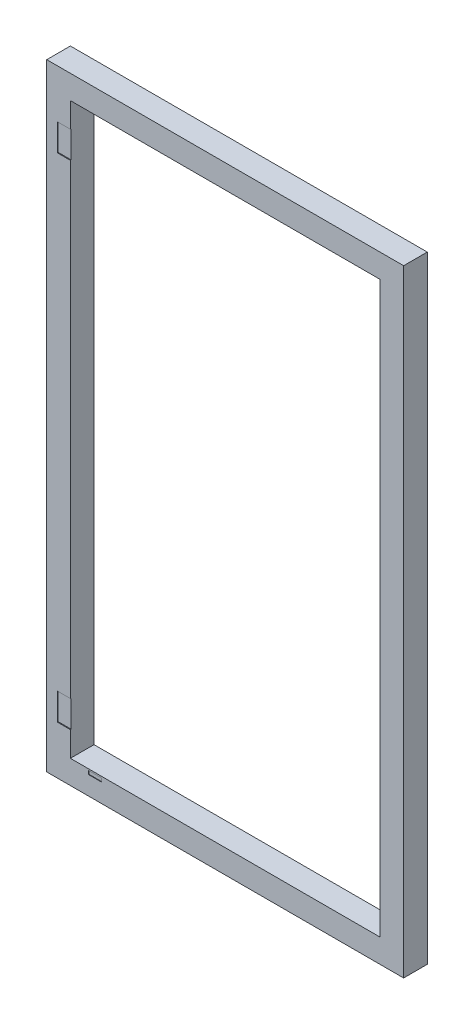
ISO-10303-21;
HEADER;
FILE_DESCRIPTION(('STEP AP214'),'2;1');
FILE_NAME('part.step','',(''),(''),'','','');
FILE_SCHEMA(('AUTOMOTIVE_DESIGN { 1 0 10303 214 1 1 1 1 }'));
ENDSEC;
DATA;
#1=APPLICATION_CONTEXT('core data for automotive mechanical design processes');
#2=APPLICATION_PROTOCOL_DEFINITION('international standard','automotive_design',2000,#1);
#3=PRODUCT_CONTEXT('',#1,'mechanical');
#4=PRODUCT('Part','Part','',(#3));
#5=PRODUCT_RELATED_PRODUCT_CATEGORY('part','',(#4));
#6=PRODUCT_DEFINITION_FORMATION('','',#4);
#7=PRODUCT_DEFINITION_CONTEXT('part definition',#1,'design');
#8=PRODUCT_DEFINITION('design','',#6,#7);
#9=PRODUCT_DEFINITION_SHAPE('','',#8);
#10=(LENGTH_UNIT() NAMED_UNIT(*) SI_UNIT(.MILLI.,.METRE.));
#11=(NAMED_UNIT(*) PLANE_ANGLE_UNIT() SI_UNIT($,.RADIAN.));
#12=(NAMED_UNIT(*) SI_UNIT($,.STERADIAN.) SOLID_ANGLE_UNIT());
#13=UNCERTAINTY_MEASURE_WITH_UNIT(LENGTH_MEASURE(1.E-05),#10,'distance_accuracy_value','');
#14=(GEOMETRIC_REPRESENTATION_CONTEXT(3) GLOBAL_UNCERTAINTY_ASSIGNED_CONTEXT((#13)) GLOBAL_UNIT_ASSIGNED_CONTEXT((#10,
#11,#12)) REPRESENTATION_CONTEXT('',''));
#15=CARTESIAN_POINT('',(0.,0.,0.));
#16=DIRECTION('',(0.,0.,1.));
#17=DIRECTION('',(1.,0.,0.));
#18=AXIS2_PLACEMENT_3D('',#15,#16,#17);
#19=CARTESIAN_POINT('',(1393.0663507109,1229.23815165877,0.01));
#20=DIRECTION('',(1.,0.,0.));
#21=DIRECTION('',(0.,0.,-1.));
#22=AXIS2_PLACEMENT_3D('',#19,#20,#21);
#23=PLANE('',#22);
#24=DIRECTION('',(0.,-1.,0.));
#25=VECTOR('',#24,1.);
#26=CARTESIAN_POINT('',(1393.0663507109,1229.23815165877,0.));
#27=LINE('',#26,#25);
#28=CARTESIAN_POINT('',(1393.0663507109,1229.23815165877,0.));
#29=VERTEX_POINT('',#28);
#30=CARTESIAN_POINT('',(1393.0663507109,1079.23815165877,0.));
#31=VERTEX_POINT('',#30);
#32=EDGE_CURVE('E140',#29,#31,#27,.T.);
#33=ORIENTED_EDGE('',*,*,#32,.F.);
#34=DIRECTION('',(0.,0.,-1.));
#35=VECTOR('',#34,1.);
#36=CARTESIAN_POINT('',(1393.0663507109,1229.23815165877,0.01));
#37=LINE('',#36,#35);
#38=CARTESIAN_POINT('',(1393.0663507109,1229.23815165877,0.01));
#39=VERTEX_POINT('',#38);
#40=EDGE_CURVE('E12',#39,#29,#37,.T.);
#41=ORIENTED_EDGE('',*,*,#40,.F.);
#42=DIRECTION('',(0.,-1.,0.));
#43=VECTOR('',#42,1.);
#44=CARTESIAN_POINT('',(1393.0663507109,1229.23815165877,0.01));
#45=LINE('',#44,#43);
#46=CARTESIAN_POINT('',(1393.0663507109,1079.23815165877,0.01));
#47=VERTEX_POINT('',#46);
#48=EDGE_CURVE('E144',#39,#47,#45,.T.);
#49=ORIENTED_EDGE('',*,*,#48,.T.);
#50=DIRECTION('',(0.,0.,-1.));
#51=VECTOR('',#50,1.);
#52=CARTESIAN_POINT('',(1393.0663507109,1079.23815165877,0.01));
#53=LINE('',#52,#51);
#54=EDGE_CURVE('E45',#47,#31,#53,.T.);
#55=ORIENTED_EDGE('',*,*,#54,.T.);
#56=EDGE_LOOP('',(#33,#41,#49,#55));
#57=FACE_BOUND('',#56,.T.);
#58=ADVANCED_FACE('F42',(#57),#23,.T.);
#59=CARTESIAN_POINT('',(1393.0663507109,1229.23815165877,0.01));
#60=DIRECTION('',(0.,1.,0.));
#61=DIRECTION('',(0.,0.,1.));
#62=AXIS2_PLACEMENT_3D('',#59,#60,#61);
#63=PLANE('',#62);
#64=DIRECTION('',(1.,0.,0.));
#65=VECTOR('',#64,1.);
#66=CARTESIAN_POINT('',(1393.0663507109,1229.23815165877,0.));
#67=LINE('',#66,#65);
#68=CARTESIAN_POINT('',(1303.0663507109,1229.23815165877,0.));
#69=VERTEX_POINT('',#68);
#70=EDGE_CURVE('E148',#69,#29,#67,.T.);
#71=ORIENTED_EDGE('',*,*,#70,.F.);
#72=DIRECTION('',(0.,0.,-1.));
#73=VECTOR('',#72,1.);
#74=CARTESIAN_POINT('',(1303.0663507109,1229.23815165877,0.01));
#75=LINE('',#74,#73);
#76=CARTESIAN_POINT('',(1303.0663507109,1229.23815165877,0.01));
#77=VERTEX_POINT('',#76);
#78=EDGE_CURVE('E50',#77,#69,#75,.T.);
#79=ORIENTED_EDGE('',*,*,#78,.F.);
#80=DIRECTION('',(1.,0.,0.));
#81=VECTOR('',#80,1.);
#82=CARTESIAN_POINT('',(1393.0663507109,1229.23815165877,0.01));
#83=LINE('',#82,#81);
#84=EDGE_CURVE('E154',#77,#39,#83,.T.);
#85=ORIENTED_EDGE('',*,*,#84,.T.);
#86=ORIENTED_EDGE('',*,*,#40,.T.);
#87=EDGE_LOOP('',(#71,#79,#85,#86));
#88=FACE_BOUND('',#87,.T.);
#89=ADVANCED_FACE('F180',(#88),#63,.T.);
#90=CARTESIAN_POINT('',(1303.0663507109,1229.23815165877,0.01));
#91=DIRECTION('',(-1.,0.,0.));
#92=DIRECTION('',(0.,0.,1.));
#93=AXIS2_PLACEMENT_3D('',#90,#91,#92);
#94=PLANE('',#93);
#95=DIRECTION('',(0.,1.,0.));
#96=VECTOR('',#95,1.);
#97=CARTESIAN_POINT('',(1303.0663507109,1229.23815165877,0.));
#98=LINE('',#97,#96);
#99=CARTESIAN_POINT('',(1303.0663507109,1079.23815165877,0.));
#100=VERTEX_POINT('',#99);
#101=EDGE_CURVE('E162',#100,#69,#98,.T.);
#102=ORIENTED_EDGE('',*,*,#101,.F.);
#103=DIRECTION('',(0.,0.,-1.));
#104=VECTOR('',#103,1.);
#105=CARTESIAN_POINT('',(1303.0663507109,1079.23815165877,0.01));
#106=LINE('',#105,#104);
#107=CARTESIAN_POINT('',(1303.0663507109,1079.23815165877,0.01));
#108=VERTEX_POINT('',#107);
#109=EDGE_CURVE('E167',#108,#100,#106,.T.);
#110=ORIENTED_EDGE('',*,*,#109,.F.);
#111=DIRECTION('',(0.,1.,0.));
#112=VECTOR('',#111,1.);
#113=CARTESIAN_POINT('',(1303.0663507109,1229.23815165877,0.01));
#114=LINE('',#113,#112);
#115=EDGE_CURVE('E151',#108,#77,#114,.T.);
#116=ORIENTED_EDGE('',*,*,#115,.T.);
#117=ORIENTED_EDGE('',*,*,#78,.T.);
#118=EDGE_LOOP('',(#102,#110,#116,#117));
#119=FACE_BOUND('',#118,.T.);
#120=ADVANCED_FACE('F184',(#119),#94,.T.);
#121=CARTESIAN_POINT('',(1393.0663507109,1079.23815165877,0.01));
#122=DIRECTION('',(0.,-1.,0.));
#123=DIRECTION('',(0.,0.,-1.));
#124=AXIS2_PLACEMENT_3D('',#121,#122,#123);
#125=PLANE('',#124);
#126=DIRECTION('',(-1.,0.,0.));
#127=VECTOR('',#126,1.);
#128=CARTESIAN_POINT('',(1393.0663507109,1079.23815165877,0.));
#129=LINE('',#128,#127);
#130=EDGE_CURVE('E159',#31,#100,#129,.T.);
#131=ORIENTED_EDGE('',*,*,#130,.F.);
#132=ORIENTED_EDGE('',*,*,#54,.F.);
#133=DIRECTION('',(-1.,0.,0.));
#134=VECTOR('',#133,1.);
#135=CARTESIAN_POINT('',(1393.0663507109,1079.23815165877,0.01));
#136=LINE('',#135,#134);
#137=EDGE_CURVE('E147',#47,#108,#136,.T.);
#138=ORIENTED_EDGE('',*,*,#137,.T.);
#139=ORIENTED_EDGE('',*,*,#109,.T.);
#140=EDGE_LOOP('',(#131,#132,#138,#139));
#141=FACE_BOUND('',#140,.T.);
#142=ADVANCED_FACE('F175',(#141),#125,.T.);
#143=CARTESIAN_POINT('',(0.,0.,0.01));
#144=DIRECTION('',(0.,0.,-1.));
#145=DIRECTION('',(-1.,0.,0.));
#146=AXIS2_PLACEMENT_3D('',#143,#144,#145);
#147=PLANE('',#146);
#148=DIRECTION('',(1.,0.,0.));
#149=VECTOR('',#148,1.);
#150=CARTESIAN_POINT('',(1353.3163507109,1104.73815165877,0.01));
#151=LINE('',#150,#149);
#152=CARTESIAN_POINT('',(1342.8163507109,1104.73815165877,0.01));
#153=VERTEX_POINT('',#152);
#154=CARTESIAN_POINT('',(1353.3163507109,1104.73815165877,0.01));
#155=VERTEX_POINT('',#154);
#156=EDGE_CURVE('E115',#153,#155,#151,.T.);
#157=ORIENTED_EDGE('',*,*,#156,.T.);
#158=DIRECTION('',(0.,-1.,0.));
#159=VECTOR('',#158,1.);
#160=CARTESIAN_POINT('',(1353.3163507109,1104.73815165877,0.01));
#161=LINE('',#160,#159);
#162=CARTESIAN_POINT('',(1353.3163507109,1094.23815165877,0.01));
#163=VERTEX_POINT('',#162);
#164=EDGE_CURVE('E109',#155,#163,#161,.T.);
#165=ORIENTED_EDGE('',*,*,#164,.T.);
#166=DIRECTION('',(-1.,0.,0.));
#167=VECTOR('',#166,1.);
#168=CARTESIAN_POINT('',(1353.3163507109,1094.23815165877,0.01));
#169=LINE('',#168,#167);
#170=CARTESIAN_POINT('',(1342.8163507109,1094.23815165877,0.01));
#171=VERTEX_POINT('',#170);
#172=EDGE_CURVE('E118',#163,#171,#169,.T.);
#173=ORIENTED_EDGE('',*,*,#172,.T.);
#174=DIRECTION('',(0.,1.,0.));
#175=VECTOR('',#174,1.);
#176=CARTESIAN_POINT('',(1342.8163507109,1104.73815165877,0.01));
#177=LINE('',#176,#175);
#178=EDGE_CURVE('E58',#171,#153,#177,.T.);
#179=ORIENTED_EDGE('',*,*,#178,.T.);
#180=EDGE_LOOP('',(#157,#165,#173,#179));
#181=FACE_BOUND('',#180,.T.);
#182=ORIENTED_EDGE('',*,*,#48,.F.);
#183=ORIENTED_EDGE('',*,*,#84,.F.);
#184=ORIENTED_EDGE('',*,*,#115,.F.);
#185=ORIENTED_EDGE('',*,*,#137,.F.);
#186=EDGE_LOOP('',(#182,#183,#184,#185));
#187=FACE_BOUND('',#186,.T.);
#188=ADVANCED_FACE('F122',(#181,#187),#147,.F.);
#189=CARTESIAN_POINT('',(0.,0.,0.));
#190=DIRECTION('',(0.,0.,-1.));
#191=DIRECTION('',(-1.,0.,0.));
#192=AXIS2_PLACEMENT_3D('',#189,#190,#191);
#193=PLANE('',#192);
#194=DIRECTION('',(0.,-1.,0.));
#195=VECTOR('',#194,1.);
#196=CARTESIAN_POINT('',(1353.3163507109,1104.73815165877,0.));
#197=LINE('',#196,#195);
#198=CARTESIAN_POINT('',(1353.3163507109,1104.73815165877,0.));
#199=VERTEX_POINT('',#198);
#200=CARTESIAN_POINT('',(1353.3163507109,1094.23815165877,0.));
#201=VERTEX_POINT('',#200);
#202=EDGE_CURVE('E66',#199,#201,#197,.T.);
#203=ORIENTED_EDGE('',*,*,#202,.F.);
#204=DIRECTION('',(1.,0.,0.));
#205=VECTOR('',#204,1.);
#206=CARTESIAN_POINT('',(1353.3163507109,1104.73815165877,0.));
#207=LINE('',#206,#205);
#208=CARTESIAN_POINT('',(1342.8163507109,1104.73815165877,0.));
#209=VERTEX_POINT('',#208);
#210=EDGE_CURVE('E125',#209,#199,#207,.T.);
#211=ORIENTED_EDGE('',*,*,#210,.F.);
#212=DIRECTION('',(0.,1.,0.));
#213=VECTOR('',#212,1.);
#214=CARTESIAN_POINT('',(1342.8163507109,1104.73815165877,0.));
#215=LINE('',#214,#213);
#216=CARTESIAN_POINT('',(1342.8163507109,1094.23815165877,0.));
#217=VERTEX_POINT('',#216);
#218=EDGE_CURVE('E128',#217,#209,#215,.T.);
#219=ORIENTED_EDGE('',*,*,#218,.F.);
#220=DIRECTION('',(-1.,0.,0.));
#221=VECTOR('',#220,1.);
#222=CARTESIAN_POINT('',(1353.3163507109,1094.23815165877,0.));
#223=LINE('',#222,#221);
#224=EDGE_CURVE('E134',#201,#217,#223,.T.);
#225=ORIENTED_EDGE('',*,*,#224,.F.);
#226=EDGE_LOOP('',(#203,#211,#219,#225));
#227=FACE_BOUND('',#226,.T.);
#228=ORIENTED_EDGE('',*,*,#32,.T.);
#229=ORIENTED_EDGE('',*,*,#130,.T.);
#230=ORIENTED_EDGE('',*,*,#101,.T.);
#231=ORIENTED_EDGE('',*,*,#70,.T.);
#232=EDGE_LOOP('',(#228,#229,#230,#231));
#233=FACE_BOUND('',#232,.T.);
#234=ADVANCED_FACE('F177',(#227,#233),#193,.T.);
#235=CARTESIAN_POINT('',(1353.3163507109,1104.73815165877,0.01));
#236=DIRECTION('',(1.,0.,0.));
#237=DIRECTION('',(0.,1.,0.));
#238=AXIS2_PLACEMENT_3D('',#235,#236,#237);
#239=PLANE('',#238);
#240=ORIENTED_EDGE('',*,*,#202,.T.);
#241=DIRECTION('',(0.,0.,-1.));
#242=VECTOR('',#241,1.);
#243=CARTESIAN_POINT('',(1353.3163507109,1094.23815165877,0.01));
#244=LINE('',#243,#242);
#245=EDGE_CURVE('E105',#163,#201,#244,.T.);
#246=ORIENTED_EDGE('',*,*,#245,.F.);
#247=ORIENTED_EDGE('',*,*,#164,.F.);
#248=DIRECTION('',(0.,0.,-1.));
#249=VECTOR('',#248,1.);
#250=CARTESIAN_POINT('',(1353.3163507109,1104.73815165877,0.01));
#251=LINE('',#250,#249);
#252=EDGE_CURVE('E138',#155,#199,#251,.T.);
#253=ORIENTED_EDGE('',*,*,#252,.T.);
#254=EDGE_LOOP('',(#240,#246,#247,#253));
#255=FACE_BOUND('',#254,.T.);
#256=ADVANCED_FACE('F107',(#255),#239,.F.);
#257=CARTESIAN_POINT('',(1353.3163507109,1104.73815165877,0.01));
#258=DIRECTION('',(0.,1.,0.));
#259=DIRECTION('',(0.,0.,1.));
#260=AXIS2_PLACEMENT_3D('',#257,#258,#259);
#261=PLANE('',#260);
#262=ORIENTED_EDGE('',*,*,#210,.T.);
#263=ORIENTED_EDGE('',*,*,#252,.F.);
#264=ORIENTED_EDGE('',*,*,#156,.F.);
#265=DIRECTION('',(0.,0.,-1.));
#266=VECTOR('',#265,1.);
#267=CARTESIAN_POINT('',(1342.8163507109,1104.73815165877,0.01));
#268=LINE('',#267,#266);
#269=EDGE_CURVE('E141',#153,#209,#268,.T.);
#270=ORIENTED_EDGE('',*,*,#269,.T.);
#271=EDGE_LOOP('',(#262,#263,#264,#270));
#272=FACE_BOUND('',#271,.T.);
#273=ADVANCED_FACE('F235',(#272),#261,.F.);
#274=CARTESIAN_POINT('',(1342.8163507109,1104.73815165877,0.01));
#275=DIRECTION('',(-1.,0.,0.));
#276=DIRECTION('',(0.,0.,1.));
#277=AXIS2_PLACEMENT_3D('',#274,#275,#276);
#278=PLANE('',#277);
#279=ORIENTED_EDGE('',*,*,#218,.T.);
#280=ORIENTED_EDGE('',*,*,#269,.F.);
#281=ORIENTED_EDGE('',*,*,#178,.F.);
#282=DIRECTION('',(0.,0.,-1.));
#283=VECTOR('',#282,1.);
#284=CARTESIAN_POINT('',(1342.8163507109,1094.23815165877,0.01));
#285=LINE('',#284,#283);
#286=EDGE_CURVE('E114',#171,#217,#285,.T.);
#287=ORIENTED_EDGE('',*,*,#286,.T.);
#288=EDGE_LOOP('',(#279,#280,#281,#287));
#289=FACE_BOUND('',#288,.T.);
#290=ADVANCED_FACE('F244',(#289),#278,.F.);
#291=CARTESIAN_POINT('',(1353.3163507109,1094.23815165877,0.01));
#292=DIRECTION('',(0.,-1.,0.));
#293=DIRECTION('',(0.,0.,-1.));
#294=AXIS2_PLACEMENT_3D('',#291,#292,#293);
#295=PLANE('',#294);
#296=ORIENTED_EDGE('',*,*,#224,.T.);
#297=ORIENTED_EDGE('',*,*,#286,.F.);
#298=ORIENTED_EDGE('',*,*,#172,.F.);
#299=ORIENTED_EDGE('',*,*,#245,.T.);
#300=EDGE_LOOP('',(#296,#297,#298,#299));
#301=FACE_BOUND('',#300,.T.);
#302=ADVANCED_FACE('F119',(#301),#295,.F.);
#303=CLOSED_SHELL('',(#58,#89,#120,#142,#188,#234,#256,#273,#290,#302));
#304=MANIFOLD_SOLID_BREP('B2',#303);
#305=CARTESIAN_POINT('',(0.,0.,100.));
#306=DIRECTION('',(0.,0.,1.));
#307=DIRECTION('',(1.,0.,0.));
#308=AXIS2_PLACEMENT_3D('',#305,#306,#307);
#309=PLANE('',#308);
#310=DIRECTION('',(-1.,0.,0.));
#311=VECTOR('',#310,1.);
#312=CARTESIAN_POINT('',(64.7840905963136,-56.9198483412322,100.));
#313=LINE('',#312,#311);
#314=CARTESIAN_POINT('',(119.784090596314,-56.9198483412322,100.));
#315=VERTEX_POINT('',#314);
#316=CARTESIAN_POINT('',(64.7840905963136,-56.9198483412322,100.));
#317=VERTEX_POINT('',#316);
#318=EDGE_CURVE('E294',#315,#317,#313,.T.);
#319=ORIENTED_EDGE('',*,*,#318,.F.);
#320=DIRECTION('',(0.,1.,0.));
#321=VECTOR('',#320,1.);
#322=CARTESIAN_POINT('',(119.784090596314,-56.9198483412322,100.));
#323=LINE('',#322,#321);
#324=CARTESIAN_POINT('',(119.784090596314,-71.9198483412322,100.));
#325=VERTEX_POINT('',#324);
#326=EDGE_CURVE('E487',#325,#315,#323,.T.);
#327=ORIENTED_EDGE('',*,*,#326,.F.);
#328=DIRECTION('',(1.,0.,0.));
#329=VECTOR('',#328,1.);
#330=CARTESIAN_POINT('',(119.784090596314,-71.9198483412322,100.));
#331=LINE('',#330,#329);
#332=CARTESIAN_POINT('',(64.7840905963136,-71.9198483412322,100.));
#333=VERTEX_POINT('',#332);
#334=EDGE_CURVE('E484',#333,#325,#331,.T.);
#335=ORIENTED_EDGE('',*,*,#334,.F.);
#336=DIRECTION('',(0.,-1.,0.));
#337=VECTOR('',#336,1.);
#338=CARTESIAN_POINT('',(64.7840905963136,-64.4198483412322,100.));
#339=LINE('',#338,#337);
#340=EDGE_CURVE('E467',#317,#333,#339,.T.);
#341=ORIENTED_EDGE('',*,*,#340,.F.);
#342=EDGE_LOOP('',(#319,#327,#335,#341));
#343=FACE_BOUND('',#342,.T.);
#344=DIRECTION('',(-1.,0.,0.));
#345=VECTOR('',#344,1.);
#346=CARTESIAN_POINT('',(-67.4336492890997,2254.23815165877,100.));
#347=LINE('',#346,#345);
#348=CARTESIAN_POINT('',(-11.9336492890997,2254.23815165877,100.));
#349=VERTEX_POINT('',#348);
#350=CARTESIAN_POINT('',(-67.4336492890997,2254.23815165877,100.));
#351=VERTEX_POINT('',#350);
#352=EDGE_CURVE('E503',#349,#351,#347,.T.);
#353=ORIENTED_EDGE('',*,*,#352,.F.);
#354=DIRECTION('',(0.,-1.,0.));
#355=VECTOR('',#354,1.);
#356=CARTESIAN_POINT('',(-11.9336492890997,2359.23815165877,100.));
#357=LINE('',#356,#355);
#358=CARTESIAN_POINT('',(-11.9336492890997,2359.23815165877,100.));
#359=VERTEX_POINT('',#358);
#360=EDGE_CURVE('E554',#359,#349,#357,.T.);
#361=ORIENTED_EDGE('',*,*,#360,.F.);
#362=DIRECTION('',(-1.,0.,0.));
#363=VECTOR('',#362,1.);
#364=CARTESIAN_POINT('',(-11.9336492890997,2359.23815165877,100.));
#365=LINE('',#364,#363);
#366=CARTESIAN_POINT('',(1298.0663507109,2359.23815165877,100.));
#367=VERTEX_POINT('',#366);
#368=EDGE_CURVE('E564',#367,#359,#365,.T.);
#369=ORIENTED_EDGE('',*,*,#368,.F.);
#370=DIRECTION('',(0.,1.,0.));
#371=VECTOR('',#370,1.);
#372=CARTESIAN_POINT('',(1298.0663507109,2359.23815165877,100.));
#373=LINE('',#372,#371);
#374=CARTESIAN_POINT('',(1298.0663507109,-50.7618483412322,100.));
#375=VERTEX_POINT('',#374);
#376=EDGE_CURVE('E561',#375,#367,#373,.T.);
#377=ORIENTED_EDGE('',*,*,#376,.F.);
#378=DIRECTION('',(1.,0.,0.));
#379=VECTOR('',#378,1.);
#380=CARTESIAN_POINT('',(-11.9336492890994,-50.7618483412322,100.));
#381=LINE('',#380,#379);
#382=CARTESIAN_POINT('',(-11.9336492890994,-50.7618483412322,100.));
#383=VERTEX_POINT('',#382);
#384=EDGE_CURVE('E557',#383,#375,#381,.T.);
#385=ORIENTED_EDGE('',*,*,#384,.F.);
#386=CARTESIAN_POINT('',(-11.9336492890997,54.2381516587678,100.));
#387=VERTEX_POINT('',#386);
#388=EDGE_CURVE('E559',#387,#383,#357,.T.);
#389=ORIENTED_EDGE('',*,*,#388,.F.);
#390=DIRECTION('',(1.,0.,0.));
#391=VECTOR('',#390,1.);
#392=CARTESIAN_POINT('',(-11.9336492890997,54.2381516587678,100.));
#393=LINE('',#392,#391);
#394=CARTESIAN_POINT('',(-67.4336492890997,54.2381516587678,100.));
#395=VERTEX_POINT('',#394);
#396=EDGE_CURVE('E532',#395,#387,#393,.T.);
#397=ORIENTED_EDGE('',*,*,#396,.F.);
#398=DIRECTION('',(0.,-1.,0.));
#399=VECTOR('',#398,1.);
#400=CARTESIAN_POINT('',(-67.4336492890997,168.238151658768,100.));
#401=LINE('',#400,#399);
#402=CARTESIAN_POINT('',(-67.4336492890997,168.238151658768,100.));
#403=VERTEX_POINT('',#402);
#404=EDGE_CURVE('E543',#403,#395,#401,.T.);
#405=ORIENTED_EDGE('',*,*,#404,.F.);
#406=DIRECTION('',(-1.,0.,0.));
#407=VECTOR('',#406,1.);
#408=CARTESIAN_POINT('',(-11.9336492890997,168.238151658768,100.));
#409=LINE('',#408,#407);
#410=CARTESIAN_POINT('',(-11.9336492890997,168.238151658768,100.));
#411=VERTEX_POINT('',#410);
#412=EDGE_CURVE('E493',#411,#403,#409,.T.);
#413=ORIENTED_EDGE('',*,*,#412,.F.);
#414=CARTESIAN_POINT('',(-11.9336492890997,2140.23815165877,100.));
#415=VERTEX_POINT('',#414);
#416=EDGE_CURVE('E558',#415,#411,#357,.T.);
#417=ORIENTED_EDGE('',*,*,#416,.F.);
#418=DIRECTION('',(1.,0.,0.));
#419=VECTOR('',#418,1.);
#420=CARTESIAN_POINT('',(-67.4336492890997,2140.23815165877,100.));
#421=LINE('',#420,#419);
#422=CARTESIAN_POINT('',(-67.4336492890997,2140.23815165877,100.));
#423=VERTEX_POINT('',#422);
#424=EDGE_CURVE('E514',#423,#415,#421,.T.);
#425=ORIENTED_EDGE('',*,*,#424,.F.);
#426=DIRECTION('',(0.,-1.,0.));
#427=VECTOR('',#426,1.);
#428=CARTESIAN_POINT('',(-67.4336492890997,2254.23815165877,100.));
#429=LINE('',#428,#427);
#430=EDGE_CURVE('E511',#351,#423,#429,.T.);
#431=ORIENTED_EDGE('',*,*,#430,.F.);
#432=EDGE_LOOP('',(#353,#361,#369,#377,#385,#389,#397,#405,#413,#417,#425,#431));
#433=FACE_BOUND('',#432,.T.);
#434=DIRECTION('',(0.,-1.,0.));
#435=VECTOR('',#434,1.);
#436=CARTESIAN_POINT('',(-111.9336492891,2459.23815165877,100.));
#437=LINE('',#436,#435);
#438=CARTESIAN_POINT('',(-111.9336492891,2459.23815165877,100.));
#439=VERTEX_POINT('',#438);
#440=CARTESIAN_POINT('',(-111.933649289099,-150.761848341232,100.));
#441=VERTEX_POINT('',#440);
#442=EDGE_CURVE('E588',#439,#441,#437,.T.);
#443=ORIENTED_EDGE('',*,*,#442,.T.);
#444=DIRECTION('',(1.,0.,0.));
#445=VECTOR('',#444,1.);
#446=CARTESIAN_POINT('',(-111.933649289099,-150.761848341232,100.));
#447=LINE('',#446,#445);
#448=CARTESIAN_POINT('',(1398.0663507109,-150.761848341232,100.));
#449=VERTEX_POINT('',#448);
#450=EDGE_CURVE('E591',#441,#449,#447,.T.);
#451=ORIENTED_EDGE('',*,*,#450,.T.);
#452=DIRECTION('',(0.,1.,0.));
#453=VECTOR('',#452,1.);
#454=CARTESIAN_POINT('',(1398.0663507109,2459.23815165877,100.));
#455=LINE('',#454,#453);
#456=CARTESIAN_POINT('',(1398.0663507109,2459.23815165877,100.));
#457=VERTEX_POINT('',#456);
#458=EDGE_CURVE('E594',#449,#457,#455,.T.);
#459=ORIENTED_EDGE('',*,*,#458,.T.);
#460=DIRECTION('',(-1.,0.,0.));
#461=VECTOR('',#460,1.);
#462=CARTESIAN_POINT('',(-111.9336492891,2459.23815165877,100.));
#463=LINE('',#462,#461);
#464=EDGE_CURVE('E596',#457,#439,#463,.T.);
#465=ORIENTED_EDGE('',*,*,#464,.T.);
#466=EDGE_LOOP('',(#443,#451,#459,#465));
#467=FACE_BOUND('',#466,.T.);
#468=ADVANCED_FACE('F271',(#343,#433,#467),#309,.T.);
#469=CARTESIAN_POINT('',(0.,0.,0.));
#470=DIRECTION('',(0.,0.,1.));
#471=DIRECTION('',(1.,0.,0.));
#472=AXIS2_PLACEMENT_3D('',#469,#470,#471);
#473=PLANE('',#472);
#474=DIRECTION('',(-1.,0.,0.));
#475=VECTOR('',#474,1.);
#476=CARTESIAN_POINT('',(1393.0663507109,1079.23815165877,0.));
#477=LINE('',#476,#475);
#478=CARTESIAN_POINT('',(1393.0663507109,1079.23815165877,0.));
#479=VERTEX_POINT('',#478);
#480=CARTESIAN_POINT('',(1303.0663507109,1079.23815165877,0.));
#481=VERTEX_POINT('',#480);
#482=EDGE_CURVE('E461',#479,#481,#477,.T.);
#483=ORIENTED_EDGE('',*,*,#482,.F.);
#484=DIRECTION('',(0.,-1.,0.));
#485=VECTOR('',#484,1.);
#486=CARTESIAN_POINT('',(1393.0663507109,1229.23815165877,0.));
#487=LINE('',#486,#485);
#488=CARTESIAN_POINT('',(1393.0663507109,1229.23815165877,0.));
#489=VERTEX_POINT('',#488);
#490=EDGE_CURVE('E286',#489,#479,#487,.T.);
#491=ORIENTED_EDGE('',*,*,#490,.F.);
#492=DIRECTION('',(1.,0.,0.));
#493=VECTOR('',#492,1.);
#494=CARTESIAN_POINT('',(1393.0663507109,1229.23815165877,0.));
#495=LINE('',#494,#493);
#496=CARTESIAN_POINT('',(1303.0663507109,1229.23815165877,0.));
#497=VERTEX_POINT('',#496);
#498=EDGE_CURVE('E452',#497,#489,#495,.T.);
#499=ORIENTED_EDGE('',*,*,#498,.F.);
#500=DIRECTION('',(0.,1.,0.));
#501=VECTOR('',#500,1.);
#502=CARTESIAN_POINT('',(1303.0663507109,1229.23815165877,0.));
#503=LINE('',#502,#501);
#504=EDGE_CURVE('E455',#481,#497,#503,.T.);
#505=ORIENTED_EDGE('',*,*,#504,.F.);
#506=EDGE_LOOP('',(#483,#491,#499,#505));
#507=FACE_BOUND('',#506,.T.);
#508=DIRECTION('',(0.,-1.,0.));
#509=VECTOR('',#508,1.);
#510=CARTESIAN_POINT('',(-111.9336492891,2459.23815165877,0.));
#511=LINE('',#510,#509);
#512=CARTESIAN_POINT('',(-111.9336492891,2459.23815165877,0.));
#513=VERTEX_POINT('',#512);
#514=CARTESIAN_POINT('',(-111.933649289099,-150.761848341232,0.));
#515=VERTEX_POINT('',#514);
#516=EDGE_CURVE('E587',#513,#515,#511,.T.);
#517=ORIENTED_EDGE('',*,*,#516,.F.);
#518=DIRECTION('',(-1.,0.,0.));
#519=VECTOR('',#518,1.);
#520=CARTESIAN_POINT('',(-111.9336492891,2459.23815165877,0.));
#521=LINE('',#520,#519);
#522=CARTESIAN_POINT('',(1398.0663507109,2459.23815165877,0.));
#523=VERTEX_POINT('',#522);
#524=EDGE_CURVE('E592',#523,#513,#521,.T.);
#525=ORIENTED_EDGE('',*,*,#524,.F.);
#526=DIRECTION('',(0.,1.,0.));
#527=VECTOR('',#526,1.);
#528=CARTESIAN_POINT('',(1398.0663507109,2459.23815165877,0.));
#529=LINE('',#528,#527);
#530=CARTESIAN_POINT('',(1398.0663507109,-150.761848341232,0.));
#531=VERTEX_POINT('',#530);
#532=EDGE_CURVE('E603',#531,#523,#529,.T.);
#533=ORIENTED_EDGE('',*,*,#532,.F.);
#534=DIRECTION('',(1.,0.,0.));
#535=VECTOR('',#534,1.);
#536=CARTESIAN_POINT('',(-111.933649289099,-150.761848341232,0.));
#537=LINE('',#536,#535);
#538=EDGE_CURVE('E601',#515,#531,#537,.T.);
#539=ORIENTED_EDGE('',*,*,#538,.F.);
#540=EDGE_LOOP('',(#517,#525,#533,#539));
#541=FACE_BOUND('',#540,.T.);
#542=DIRECTION('',(0.,-1.,0.));
#543=VECTOR('',#542,1.);
#544=CARTESIAN_POINT('',(-11.9336492890997,2359.23815165877,0.));
#545=LINE('',#544,#543);
#546=CARTESIAN_POINT('',(-11.9336492890997,2359.23815165877,0.));
#547=VERTEX_POINT('',#546);
#548=CARTESIAN_POINT('',(-11.9336492890994,-50.7618483412322,0.));
#549=VERTEX_POINT('',#548);
#550=EDGE_CURVE('E521',#547,#549,#545,.T.);
#551=ORIENTED_EDGE('',*,*,#550,.T.);
#552=DIRECTION('',(1.,0.,0.));
#553=VECTOR('',#552,1.);
#554=CARTESIAN_POINT('',(-11.9336492890994,-50.7618483412322,0.));
#555=LINE('',#554,#553);
#556=CARTESIAN_POINT('',(1298.0663507109,-50.7618483412322,0.));
#557=VERTEX_POINT('',#556);
#558=EDGE_CURVE('E569',#549,#557,#555,.T.);
#559=ORIENTED_EDGE('',*,*,#558,.T.);
#560=DIRECTION('',(0.,1.,0.));
#561=VECTOR('',#560,1.);
#562=CARTESIAN_POINT('',(1298.0663507109,2359.23815165877,0.));
#563=LINE('',#562,#561);
#564=CARTESIAN_POINT('',(1298.0663507109,2359.23815165877,0.));
#565=VERTEX_POINT('',#564);
#566=EDGE_CURVE('E572',#557,#565,#563,.T.);
#567=ORIENTED_EDGE('',*,*,#566,.T.);
#568=DIRECTION('',(-1.,0.,0.));
#569=VECTOR('',#568,1.);
#570=CARTESIAN_POINT('',(-11.9336492890997,2359.23815165877,0.));
#571=LINE('',#570,#569);
#572=EDGE_CURVE('E575',#565,#547,#571,.T.);
#573=ORIENTED_EDGE('',*,*,#572,.T.);
#574=EDGE_LOOP('',(#551,#559,#567,#573));
#575=FACE_BOUND('',#574,.T.);
#576=ADVANCED_FACE('F621',(#507,#541,#575),#473,.F.);
#577=CARTESIAN_POINT('',(-111.9336492891,2459.23815165877,100.));
#578=DIRECTION('',(1.,0.,0.));
#579=DIRECTION('',(0.,1.,0.));
#580=AXIS2_PLACEMENT_3D('',#577,#578,#579);
#581=PLANE('',#580);
#582=ORIENTED_EDGE('',*,*,#516,.T.);
#583=DIRECTION('',(0.,0.,-1.));
#584=VECTOR('',#583,1.);
#585=CARTESIAN_POINT('',(-111.933649289099,-150.761848341232,100.));
#586=LINE('',#585,#584);
#587=EDGE_CURVE('E40',#441,#515,#586,.T.);
#588=ORIENTED_EDGE('',*,*,#587,.F.);
#589=ORIENTED_EDGE('',*,*,#442,.F.);
#590=DIRECTION('',(0.,0.,-1.));
#591=VECTOR('',#590,1.);
#592=CARTESIAN_POINT('',(-111.9336492891,2459.23815165877,100.));
#593=LINE('',#592,#591);
#594=EDGE_CURVE('E598',#439,#513,#593,.T.);
#595=ORIENTED_EDGE('',*,*,#594,.T.);
#596=EDGE_LOOP('',(#582,#588,#589,#595));
#597=FACE_BOUND('',#596,.T.);
#598=ADVANCED_FACE('F273',(#597),#581,.F.);
#599=CARTESIAN_POINT('',(-111.933649289099,-150.761848341232,100.));
#600=DIRECTION('',(0.,1.,0.));
#601=DIRECTION('',(0.,0.,1.));
#602=AXIS2_PLACEMENT_3D('',#599,#600,#601);
#603=PLANE('',#602);
#604=ORIENTED_EDGE('',*,*,#538,.T.);
#605=DIRECTION('',(0.,0.,-1.));
#606=VECTOR('',#605,1.);
#607=CARTESIAN_POINT('',(1398.0663507109,-150.761848341232,100.));
#608=LINE('',#607,#606);
#609=EDGE_CURVE('E279',#449,#531,#608,.T.);
#610=ORIENTED_EDGE('',*,*,#609,.F.);
#611=ORIENTED_EDGE('',*,*,#450,.F.);
#612=ORIENTED_EDGE('',*,*,#587,.T.);
#613=EDGE_LOOP('',(#604,#610,#611,#612));
#614=FACE_BOUND('',#613,.T.);
#615=ADVANCED_FACE('F631',(#614),#603,.F.);
#616=CARTESIAN_POINT('',(1398.0663507109,2459.23815165877,100.));
#617=DIRECTION('',(-1.,0.,0.));
#618=DIRECTION('',(0.,-1.,0.));
#619=AXIS2_PLACEMENT_3D('',#616,#617,#618);
#620=PLANE('',#619);
#621=ORIENTED_EDGE('',*,*,#532,.T.);
#622=DIRECTION('',(0.,0.,-1.));
#623=VECTOR('',#622,1.);
#624=CARTESIAN_POINT('',(1398.0663507109,2459.23815165877,100.));
#625=LINE('',#624,#623);
#626=EDGE_CURVE('E608',#457,#523,#625,.T.);
#627=ORIENTED_EDGE('',*,*,#626,.F.);
#628=ORIENTED_EDGE('',*,*,#458,.F.);
#629=ORIENTED_EDGE('',*,*,#609,.T.);
#630=EDGE_LOOP('',(#621,#627,#628,#629));
#631=FACE_BOUND('',#630,.T.);
#632=ADVANCED_FACE('F615',(#631),#620,.F.);
#633=CARTESIAN_POINT('',(-111.9336492891,2459.23815165877,100.));
#634=DIRECTION('',(0.,-1.,0.));
#635=DIRECTION('',(0.,0.,-1.));
#636=AXIS2_PLACEMENT_3D('',#633,#634,#635);
#637=PLANE('',#636);
#638=ORIENTED_EDGE('',*,*,#524,.T.);
#639=ORIENTED_EDGE('',*,*,#594,.F.);
#640=ORIENTED_EDGE('',*,*,#464,.F.);
#641=ORIENTED_EDGE('',*,*,#626,.T.);
#642=EDGE_LOOP('',(#638,#639,#640,#641));
#643=FACE_BOUND('',#642,.T.);
#644=ADVANCED_FACE('F625',(#643),#637,.F.);
#645=CARTESIAN_POINT('',(-11.9336492890997,2359.23815165877,100.));
#646=DIRECTION('',(1.,0.,0.));
#647=DIRECTION('',(0.,1.,0.));
#648=AXIS2_PLACEMENT_3D('',#645,#646,#647);
#649=PLANE('',#648);
#650=DIRECTION('',(0.,0.,1.));
#651=VECTOR('',#650,1.);
#652=CARTESIAN_POINT('',(-11.9336492890997,2254.23815165877,96.6));
#653=LINE('',#652,#651);
#654=CARTESIAN_POINT('',(-11.9336492890997,2254.23815165877,96.6));
#655=VERTEX_POINT('',#654);
#656=EDGE_CURVE('E522',#655,#349,#653,.T.);
#657=ORIENTED_EDGE('',*,*,#656,.F.);
#658=DIRECTION('',(0.,1.,0.));
#659=VECTOR('',#658,1.);
#660=CARTESIAN_POINT('',(-11.9336492890997,2254.23815165877,96.6));
#661=LINE('',#660,#659);
#662=CARTESIAN_POINT('',(-11.9336492890997,2140.23815165877,96.6));
#663=VERTEX_POINT('',#662);
#664=EDGE_CURVE('E505',#663,#655,#661,.T.);
#665=ORIENTED_EDGE('',*,*,#664,.F.);
#666=DIRECTION('',(0.,0.,1.));
#667=VECTOR('',#666,1.);
#668=CARTESIAN_POINT('',(-11.9336492890997,2140.23815165877,96.6));
#669=LINE('',#668,#667);
#670=EDGE_CURVE('E524',#663,#415,#669,.T.);
#671=ORIENTED_EDGE('',*,*,#670,.T.);
#672=ORIENTED_EDGE('',*,*,#416,.T.);
#673=DIRECTION('',(0.,0.,1.));
#674=VECTOR('',#673,1.);
#675=CARTESIAN_POINT('',(-11.9336492890997,168.238151658768,96.6));
#676=LINE('',#675,#674);
#677=CARTESIAN_POINT('',(-11.9336492890997,168.238151658768,96.6));
#678=VERTEX_POINT('',#677);
#679=EDGE_CURVE('E540',#678,#411,#676,.T.);
#680=ORIENTED_EDGE('',*,*,#679,.F.);
#681=DIRECTION('',(0.,1.,0.));
#682=VECTOR('',#681,1.);
#683=CARTESIAN_POINT('',(-11.9336492890997,168.238151658768,96.6));
#684=LINE('',#683,#682);
#685=CARTESIAN_POINT('',(-11.9336492890994,54.238151658768,96.6));
#686=VERTEX_POINT('',#685);
#687=EDGE_CURVE('E528',#686,#678,#684,.T.);
#688=ORIENTED_EDGE('',*,*,#687,.F.);
#689=DIRECTION('',(0.,0.,1.));
#690=VECTOR('',#689,1.);
#691=CARTESIAN_POINT('',(-11.9336492890997,54.2381516587678,96.6));
#692=LINE('',#691,#690);
#693=EDGE_CURVE('E515',#686,#387,#692,.T.);
#694=ORIENTED_EDGE('',*,*,#693,.T.);
#695=ORIENTED_EDGE('',*,*,#388,.T.);
#696=DIRECTION('',(0.,0.,-1.));
#697=VECTOR('',#696,1.);
#698=CARTESIAN_POINT('',(-11.9336492890994,-50.7618483412322,100.));
#699=LINE('',#698,#697);
#700=EDGE_CURVE('E584',#383,#549,#699,.T.);
#701=ORIENTED_EDGE('',*,*,#700,.T.);
#702=ORIENTED_EDGE('',*,*,#550,.F.);
#703=DIRECTION('',(0.,0.,-1.));
#704=VECTOR('',#703,1.);
#705=CARTESIAN_POINT('',(-11.9336492890997,2359.23815165877,100.));
#706=LINE('',#705,#704);
#707=EDGE_CURVE('E566',#359,#547,#706,.T.);
#708=ORIENTED_EDGE('',*,*,#707,.F.);
#709=ORIENTED_EDGE('',*,*,#360,.T.);
#710=EDGE_LOOP('',(#657,#665,#671,#672,#680,#688,#694,#695,#701,#702,#708,#709));
#711=FACE_BOUND('',#710,.T.);
#712=ADVANCED_FACE('F648',(#711),#649,.T.);
#713=CARTESIAN_POINT('',(-11.9336492890994,-50.7618483412322,100.));
#714=DIRECTION('',(0.,1.,0.));
#715=DIRECTION('',(0.,0.,1.));
#716=AXIS2_PLACEMENT_3D('',#713,#714,#715);
#717=PLANE('',#716);
#718=ORIENTED_EDGE('',*,*,#558,.F.);
#719=ORIENTED_EDGE('',*,*,#700,.F.);
#720=ORIENTED_EDGE('',*,*,#384,.T.);
#721=DIRECTION('',(0.,0.,-1.));
#722=VECTOR('',#721,1.);
#723=CARTESIAN_POINT('',(1298.0663507109,-50.7618483412322,100.));
#724=LINE('',#723,#722);
#725=EDGE_CURVE('E582',#375,#557,#724,.T.);
#726=ORIENTED_EDGE('',*,*,#725,.T.);
#727=EDGE_LOOP('',(#718,#719,#720,#726));
#728=FACE_BOUND('',#727,.T.);
#729=ADVANCED_FACE('F655',(#728),#717,.T.);
#730=CARTESIAN_POINT('',(1298.0663507109,2359.23815165877,100.));
#731=DIRECTION('',(-1.,0.,0.));
#732=DIRECTION('',(0.,-1.,0.));
#733=AXIS2_PLACEMENT_3D('',#730,#731,#732);
#734=PLANE('',#733);
#735=ORIENTED_EDGE('',*,*,#566,.F.);
#736=ORIENTED_EDGE('',*,*,#725,.F.);
#737=ORIENTED_EDGE('',*,*,#376,.T.);
#738=DIRECTION('',(0.,0.,-1.));
#739=VECTOR('',#738,1.);
#740=CARTESIAN_POINT('',(1298.0663507109,2359.23815165877,100.));
#741=LINE('',#740,#739);
#742=EDGE_CURVE('E580',#367,#565,#741,.T.);
#743=ORIENTED_EDGE('',*,*,#742,.T.);
#744=EDGE_LOOP('',(#735,#736,#737,#743));
#745=FACE_BOUND('',#744,.T.);
#746=ADVANCED_FACE('F660',(#745),#734,.T.);
#747=CARTESIAN_POINT('',(-11.9336492890997,2359.23815165877,100.));
#748=DIRECTION('',(0.,-1.,0.));
#749=DIRECTION('',(0.,0.,-1.));
#750=AXIS2_PLACEMENT_3D('',#747,#748,#749);
#751=PLANE('',#750);
#752=ORIENTED_EDGE('',*,*,#572,.F.);
#753=ORIENTED_EDGE('',*,*,#742,.F.);
#754=ORIENTED_EDGE('',*,*,#368,.T.);
#755=ORIENTED_EDGE('',*,*,#707,.T.);
#756=EDGE_LOOP('',(#752,#753,#754,#755));
#757=FACE_BOUND('',#756,.T.);
#758=ADVANCED_FACE('F699',(#757),#751,.T.);
#759=CARTESIAN_POINT('',(-11.9336492890997,54.2381516587678,96.6));
#760=DIRECTION('',(0.,-1.,0.));
#761=DIRECTION('',(1.,0.,0.));
#762=AXIS2_PLACEMENT_3D('',#759,#760,#761);
#763=PLANE('',#762);
#764=ORIENTED_EDGE('',*,*,#396,.T.);
#765=ORIENTED_EDGE('',*,*,#693,.F.);
#766=DIRECTION('',(1.,0.,0.));
#767=VECTOR('',#766,1.);
#768=CARTESIAN_POINT('',(-11.9336492890997,54.2381516587678,96.6));
#769=LINE('',#768,#767);
#770=CARTESIAN_POINT('',(-67.4336492890997,54.2381516587678,96.6));
#771=VERTEX_POINT('',#770);
#772=EDGE_CURVE('E538',#771,#686,#769,.T.);
#773=ORIENTED_EDGE('',*,*,#772,.F.);
#774=DIRECTION('',(0.,0.,1.));
#775=VECTOR('',#774,1.);
#776=CARTESIAN_POINT('',(-67.4336492890997,54.2381516587678,96.6));
#777=LINE('',#776,#775);
#778=EDGE_CURVE('E549',#771,#395,#777,.T.);
#779=ORIENTED_EDGE('',*,*,#778,.T.);
#780=EDGE_LOOP('',(#764,#765,#773,#779));
#781=FACE_BOUND('',#780,.T.);
#782=ADVANCED_FACE('F701',(#781),#763,.F.);
#783=CARTESIAN_POINT('',(-67.4336492890997,168.238151658768,96.6));
#784=DIRECTION('',(-1.,0.,0.));
#785=DIRECTION('',(0.,-1.,0.));
#786=AXIS2_PLACEMENT_3D('',#783,#784,#785);
#787=PLANE('',#786);
#788=ORIENTED_EDGE('',*,*,#404,.T.);
#789=ORIENTED_EDGE('',*,*,#778,.F.);
#790=DIRECTION('',(0.,-1.,0.));
#791=VECTOR('',#790,1.);
#792=CARTESIAN_POINT('',(-67.4336492890997,168.238151658768,96.6));
#793=LINE('',#792,#791);
#794=CARTESIAN_POINT('',(-67.4336492890997,168.238151658768,96.6));
#795=VERTEX_POINT('',#794);
#796=EDGE_CURVE('E535',#795,#771,#793,.T.);
#797=ORIENTED_EDGE('',*,*,#796,.F.);
#798=DIRECTION('',(0.,0.,1.));
#799=VECTOR('',#798,1.);
#800=CARTESIAN_POINT('',(-67.4336492890997,168.238151658768,96.6));
#801=LINE('',#800,#799);
#802=EDGE_CURVE('E551',#795,#403,#801,.T.);
#803=ORIENTED_EDGE('',*,*,#802,.T.);
#804=EDGE_LOOP('',(#788,#789,#797,#803));
#805=FACE_BOUND('',#804,.T.);
#806=ADVANCED_FACE('F707',(#805),#787,.F.);
#807=CARTESIAN_POINT('',(-11.9336492890997,168.238151658768,96.6));
#808=DIRECTION('',(0.,1.,0.));
#809=DIRECTION('',(-1.,0.,0.));
#810=AXIS2_PLACEMENT_3D('',#807,#808,#809);
#811=PLANE('',#810);
#812=ORIENTED_EDGE('',*,*,#412,.T.);
#813=ORIENTED_EDGE('',*,*,#802,.F.);
#814=DIRECTION('',(-1.,0.,0.));
#815=VECTOR('',#814,1.);
#816=CARTESIAN_POINT('',(-11.9336492890997,168.238151658768,96.6));
#817=LINE('',#816,#815);
#818=EDGE_CURVE('E531',#678,#795,#817,.T.);
#819=ORIENTED_EDGE('',*,*,#818,.F.);
#820=ORIENTED_EDGE('',*,*,#679,.T.);
#821=EDGE_LOOP('',(#812,#813,#819,#820));
#822=FACE_BOUND('',#821,.T.);
#823=ADVANCED_FACE('F712',(#822),#811,.F.);
#824=CARTESIAN_POINT('',(0.,0.,96.6));
#825=DIRECTION('',(0.,0.,-1.));
#826=DIRECTION('',(-1.,0.,0.));
#827=AXIS2_PLACEMENT_3D('',#824,#825,#826);
#828=PLANE('',#827);
#829=ORIENTED_EDGE('',*,*,#687,.T.);
#830=ORIENTED_EDGE('',*,*,#818,.T.);
#831=ORIENTED_EDGE('',*,*,#796,.T.);
#832=ORIENTED_EDGE('',*,*,#772,.T.);
#833=EDGE_LOOP('',(#829,#830,#831,#832));
#834=FACE_BOUND('',#833,.T.);
#835=ADVANCED_FACE('F715',(#834),#828,.F.);
#836=CARTESIAN_POINT('',(-67.4336492890997,2254.23815165877,96.6));
#837=DIRECTION('',(-1.,0.,0.));
#838=DIRECTION('',(0.,-1.,0.));
#839=AXIS2_PLACEMENT_3D('',#836,#837,#838);
#840=PLANE('',#839);
#841=ORIENTED_EDGE('',*,*,#430,.T.);
#842=DIRECTION('',(0.,0.,1.));
#843=VECTOR('',#842,1.);
#844=CARTESIAN_POINT('',(-67.4336492890997,2140.23815165877,96.6));
#845=LINE('',#844,#843);
#846=CARTESIAN_POINT('',(-67.4336492890997,2140.23815165877,96.6));
#847=VERTEX_POINT('',#846);
#848=EDGE_CURVE('E510',#847,#423,#845,.T.);
#849=ORIENTED_EDGE('',*,*,#848,.F.);
#850=DIRECTION('',(0.,-1.,0.));
#851=VECTOR('',#850,1.);
#852=CARTESIAN_POINT('',(-67.4336492890997,2254.23815165877,96.6));
#853=LINE('',#852,#851);
#854=CARTESIAN_POINT('',(-67.4336492890997,2254.23815165877,96.6));
#855=VERTEX_POINT('',#854);
#856=EDGE_CURVE('E499',#855,#847,#853,.T.);
#857=ORIENTED_EDGE('',*,*,#856,.F.);
#858=DIRECTION('',(0.,0.,1.));
#859=VECTOR('',#858,1.);
#860=CARTESIAN_POINT('',(-67.4336492890997,2254.23815165877,96.6));
#861=LINE('',#860,#859);
#862=EDGE_CURVE('E519',#855,#351,#861,.T.);
#863=ORIENTED_EDGE('',*,*,#862,.T.);
#864=EDGE_LOOP('',(#841,#849,#857,#863));
#865=FACE_BOUND('',#864,.T.);
#866=ADVANCED_FACE('F675',(#865),#840,.F.);
#867=CARTESIAN_POINT('',(-67.4336492890997,2254.23815165877,96.6));
#868=DIRECTION('',(0.,1.,0.));
#869=DIRECTION('',(0.,0.,1.));
#870=AXIS2_PLACEMENT_3D('',#867,#868,#869);
#871=PLANE('',#870);
#872=ORIENTED_EDGE('',*,*,#352,.T.);
#873=ORIENTED_EDGE('',*,*,#862,.F.);
#874=DIRECTION('',(-1.,0.,0.));
#875=VECTOR('',#874,1.);
#876=CARTESIAN_POINT('',(-67.4336492890997,2254.23815165877,96.6));
#877=LINE('',#876,#875);
#878=EDGE_CURVE('E507',#655,#855,#877,.T.);
#879=ORIENTED_EDGE('',*,*,#878,.F.);
#880=ORIENTED_EDGE('',*,*,#656,.T.);
#881=EDGE_LOOP('',(#872,#873,#879,#880));
#882=FACE_BOUND('',#881,.T.);
#883=ADVANCED_FACE('F669',(#882),#871,.F.);
#884=CARTESIAN_POINT('',(-67.4336492890997,2140.23815165877,96.6));
#885=DIRECTION('',(0.,-1.,0.));
#886=DIRECTION('',(0.,0.,-1.));
#887=AXIS2_PLACEMENT_3D('',#884,#885,#886);
#888=PLANE('',#887);
#889=ORIENTED_EDGE('',*,*,#424,.T.);
#890=ORIENTED_EDGE('',*,*,#670,.F.);
#891=DIRECTION('',(1.,0.,0.));
#892=VECTOR('',#891,1.);
#893=CARTESIAN_POINT('',(-67.4336492890997,2140.23815165877,96.6));
#894=LINE('',#893,#892);
#895=EDGE_CURVE('E502',#847,#663,#894,.T.);
#896=ORIENTED_EDGE('',*,*,#895,.F.);
#897=ORIENTED_EDGE('',*,*,#848,.T.);
#898=EDGE_LOOP('',(#889,#890,#896,#897));
#899=FACE_BOUND('',#898,.T.);
#900=ADVANCED_FACE('F682',(#899),#888,.F.);
#901=CARTESIAN_POINT('',(0.,0.,96.6));
#902=DIRECTION('',(0.,0.,1.));
#903=DIRECTION('',(1.,0.,0.));
#904=AXIS2_PLACEMENT_3D('',#901,#902,#903);
#905=PLANE('',#904);
#906=ORIENTED_EDGE('',*,*,#856,.T.);
#907=ORIENTED_EDGE('',*,*,#895,.T.);
#908=ORIENTED_EDGE('',*,*,#664,.T.);
#909=ORIENTED_EDGE('',*,*,#878,.T.);
#910=EDGE_LOOP('',(#906,#907,#908,#909));
#911=FACE_BOUND('',#910,.T.);
#912=ADVANCED_FACE('F679',(#911),#905,.T.);
#913=CARTESIAN_POINT('',(64.7840905963136,-56.9198483412322,98.));
#914=DIRECTION('',(0.,1.,0.));
#915=DIRECTION('',(0.,0.,1.));
#916=AXIS2_PLACEMENT_3D('',#913,#914,#915);
#917=PLANE('',#916);
#918=ORIENTED_EDGE('',*,*,#318,.T.);
#919=DIRECTION('',(0.,0.,1.));
#920=VECTOR('',#919,1.);
#921=CARTESIAN_POINT('',(64.7840905963136,-56.9198483412322,98.));
#922=LINE('',#921,#920);
#923=CARTESIAN_POINT('',(64.7840905963136,-56.9198483412322,98.));
#924=VERTEX_POINT('',#923);
#925=EDGE_CURVE('E491',#924,#317,#922,.T.);
#926=ORIENTED_EDGE('',*,*,#925,.F.);
#927=DIRECTION('',(-1.,0.,0.));
#928=VECTOR('',#927,1.);
#929=CARTESIAN_POINT('',(64.7840905963136,-56.9198483412322,98.));
#930=LINE('',#929,#928);
#931=CARTESIAN_POINT('',(119.784090596314,-56.9198483412322,98.));
#932=VERTEX_POINT('',#931);
#933=EDGE_CURVE('E478',#932,#924,#930,.T.);
#934=ORIENTED_EDGE('',*,*,#933,.F.);
#935=DIRECTION('',(0.,0.,1.));
#936=VECTOR('',#935,1.);
#937=CARTESIAN_POINT('',(119.784090596314,-56.9198483412322,98.));
#938=LINE('',#937,#936);
#939=EDGE_CURVE('E494',#932,#315,#938,.T.);
#940=ORIENTED_EDGE('',*,*,#939,.T.);
#941=EDGE_LOOP('',(#918,#926,#934,#940));
#942=FACE_BOUND('',#941,.T.);
#943=ADVANCED_FACE('F731',(#942),#917,.F.);
#944=CARTESIAN_POINT('',(119.784090596314,-56.9198483412322,98.));
#945=DIRECTION('',(1.,0.,0.));
#946=DIRECTION('',(0.,0.,-1.));
#947=AXIS2_PLACEMENT_3D('',#944,#945,#946);
#948=PLANE('',#947);
#949=ORIENTED_EDGE('',*,*,#326,.T.);
#950=ORIENTED_EDGE('',*,*,#939,.F.);
#951=DIRECTION('',(0.,1.,0.));
#952=VECTOR('',#951,1.);
#953=CARTESIAN_POINT('',(119.784090596314,-56.9198483412322,98.));
#954=LINE('',#953,#952);
#955=CARTESIAN_POINT('',(119.784090596314,-71.9198483412322,98.));
#956=VERTEX_POINT('',#955);
#957=EDGE_CURVE('E475',#956,#932,#954,.T.);
#958=ORIENTED_EDGE('',*,*,#957,.F.);
#959=DIRECTION('',(0.,0.,1.));
#960=VECTOR('',#959,1.);
#961=CARTESIAN_POINT('',(119.784090596314,-71.9198483412322,98.));
#962=LINE('',#961,#960);
#963=EDGE_CURVE('E496',#956,#325,#962,.T.);
#964=ORIENTED_EDGE('',*,*,#963,.T.);
#965=EDGE_LOOP('',(#949,#950,#958,#964));
#966=FACE_BOUND('',#965,.T.);
#967=ADVANCED_FACE('F740',(#966),#948,.F.);
#968=CARTESIAN_POINT('',(119.784090596314,-71.9198483412322,98.));
#969=DIRECTION('',(0.,-1.,0.));
#970=DIRECTION('',(0.,0.,-1.));
#971=AXIS2_PLACEMENT_3D('',#968,#969,#970);
#972=PLANE('',#971);
#973=ORIENTED_EDGE('',*,*,#334,.T.);
#974=ORIENTED_EDGE('',*,*,#963,.F.);
#975=DIRECTION('',(1.,0.,0.));
#976=VECTOR('',#975,1.);
#977=CARTESIAN_POINT('',(64.7840905963136,-71.9198483412322,98.));
#978=LINE('',#977,#976);
#979=CARTESIAN_POINT('',(64.7840905963136,-71.9198483412322,98.));
#980=VERTEX_POINT('',#979);
#981=EDGE_CURVE('E473',#980,#956,#978,.T.);
#982=ORIENTED_EDGE('',*,*,#981,.F.);
#983=DIRECTION('',(0.,0.,1.));
#984=VECTOR('',#983,1.);
#985=CARTESIAN_POINT('',(64.7840905963136,-71.9198483412322,98.));
#986=LINE('',#985,#984);
#987=EDGE_CURVE('E481',#980,#333,#986,.T.);
#988=ORIENTED_EDGE('',*,*,#987,.T.);
#989=EDGE_LOOP('',(#973,#974,#982,#988));
#990=FACE_BOUND('',#989,.T.);
#991=ADVANCED_FACE('F736',(#990),#972,.F.);
#992=CARTESIAN_POINT('',(64.7840905963136,-64.4198483412322,98.));
#993=DIRECTION('',(-1.,0.,0.));
#994=DIRECTION('',(0.,0.,1.));
#995=AXIS2_PLACEMENT_3D('',#992,#993,#994);
#996=PLANE('',#995);
#997=ORIENTED_EDGE('',*,*,#340,.T.);
#998=ORIENTED_EDGE('',*,*,#987,.F.);
#999=DIRECTION('',(0.,-1.,0.));
#1000=VECTOR('',#999,1.);
#1001=CARTESIAN_POINT('',(64.7840905963136,-56.9198483412322,98.));
#1002=LINE('',#1001,#1000);
#1003=EDGE_CURVE('E471',#924,#980,#1002,.T.);
#1004=ORIENTED_EDGE('',*,*,#1003,.F.);
#1005=ORIENTED_EDGE('',*,*,#925,.T.);
#1006=EDGE_LOOP('',(#997,#998,#1004,#1005));
#1007=FACE_BOUND('',#1006,.T.);
#1008=ADVANCED_FACE('F732',(#1007),#996,.F.);
#1009=CARTESIAN_POINT('',(0.,0.,98.));
#1010=DIRECTION('',(0.,0.,1.));
#1011=DIRECTION('',(1.,0.,0.));
#1012=AXIS2_PLACEMENT_3D('',#1009,#1010,#1011);
#1013=PLANE('',#1012);
#1014=ORIENTED_EDGE('',*,*,#1003,.T.);
#1015=ORIENTED_EDGE('',*,*,#981,.T.);
#1016=ORIENTED_EDGE('',*,*,#957,.T.);
#1017=ORIENTED_EDGE('',*,*,#933,.T.);
#1018=EDGE_LOOP('',(#1014,#1015,#1016,#1017));
#1019=FACE_BOUND('',#1018,.T.);
#1020=ADVANCED_FACE('F735',(#1019),#1013,.T.);
#1021=CARTESIAN_POINT('',(1393.0663507109,1229.23815165877,81.));
#1022=DIRECTION('',(1.,0.,0.));
#1023=DIRECTION('',(0.,0.,-1.));
#1024=AXIS2_PLACEMENT_3D('',#1021,#1022,#1023);
#1025=PLANE('',#1024);
#1026=ORIENTED_EDGE('',*,*,#490,.T.);
#1027=DIRECTION('',(0.,0.,-1.));
#1028=VECTOR('',#1027,1.);
#1029=CARTESIAN_POINT('',(1393.0663507109,1079.23815165877,81.));
#1030=LINE('',#1029,#1028);
#1031=CARTESIAN_POINT('',(1393.0663507109,1079.23815165877,81.));
#1032=VERTEX_POINT('',#1031);
#1033=EDGE_CURVE('E430',#1032,#479,#1030,.T.);
#1034=ORIENTED_EDGE('',*,*,#1033,.F.);
#1035=DIRECTION('',(0.,-1.,0.));
#1036=VECTOR('',#1035,1.);
#1037=CARTESIAN_POINT('',(1393.0663507109,1229.23815165877,81.));
#1038=LINE('',#1037,#1036);
#1039=CARTESIAN_POINT('',(1393.0663507109,1229.23815165877,81.));
#1040=VERTEX_POINT('',#1039);
#1041=EDGE_CURVE('E434',#1040,#1032,#1038,.T.);
#1042=ORIENTED_EDGE('',*,*,#1041,.F.);
#1043=DIRECTION('',(0.,0.,-1.));
#1044=VECTOR('',#1043,1.);
#1045=CARTESIAN_POINT('',(1393.0663507109,1229.23815165877,81.));
#1046=LINE('',#1045,#1044);
#1047=EDGE_CURVE('E465',#1040,#489,#1046,.T.);
#1048=ORIENTED_EDGE('',*,*,#1047,.T.);
#1049=EDGE_LOOP('',(#1026,#1034,#1042,#1048));
#1050=FACE_BOUND('',#1049,.T.);
#1051=ADVANCED_FACE('F432',(#1050),#1025,.F.);
#1052=CARTESIAN_POINT('',(1393.0663507109,1229.23815165877,81.));
#1053=DIRECTION('',(0.,1.,0.));
#1054=DIRECTION('',(0.,0.,1.));
#1055=AXIS2_PLACEMENT_3D('',#1052,#1053,#1054);
#1056=PLANE('',#1055);
#1057=ORIENTED_EDGE('',*,*,#498,.T.);
#1058=ORIENTED_EDGE('',*,*,#1047,.F.);
#1059=DIRECTION('',(1.,0.,0.));
#1060=VECTOR('',#1059,1.);
#1061=CARTESIAN_POINT('',(1393.0663507109,1229.23815165877,81.));
#1062=LINE('',#1061,#1060);
#1063=CARTESIAN_POINT('',(1303.0663507109,1229.23815165877,81.));
#1064=VERTEX_POINT('',#1063);
#1065=EDGE_CURVE('E440',#1064,#1040,#1062,.T.);
#1066=ORIENTED_EDGE('',*,*,#1065,.F.);
#1067=DIRECTION('',(0.,0.,-1.));
#1068=VECTOR('',#1067,1.);
#1069=CARTESIAN_POINT('',(1303.0663507109,1229.23815165877,81.));
#1070=LINE('',#1069,#1068);
#1071=EDGE_CURVE('E468',#1064,#497,#1070,.T.);
#1072=ORIENTED_EDGE('',*,*,#1071,.T.);
#1073=EDGE_LOOP('',(#1057,#1058,#1066,#1072));
#1074=FACE_BOUND('',#1073,.T.);
#1075=ADVANCED_FACE('F752',(#1074),#1056,.F.);
#1076=CARTESIAN_POINT('',(1303.0663507109,1229.23815165877,81.));
#1077=DIRECTION('',(-1.,0.,0.));
#1078=DIRECTION('',(0.,0.,1.));
#1079=AXIS2_PLACEMENT_3D('',#1076,#1077,#1078);
#1080=PLANE('',#1079);
#1081=ORIENTED_EDGE('',*,*,#504,.T.);
#1082=ORIENTED_EDGE('',*,*,#1071,.F.);
#1083=DIRECTION('',(0.,1.,0.));
#1084=VECTOR('',#1083,1.);
#1085=CARTESIAN_POINT('',(1303.0663507109,1229.23815165877,81.));
#1086=LINE('',#1085,#1084);
#1087=CARTESIAN_POINT('',(1303.0663507109,1079.23815165877,81.));
#1088=VERTEX_POINT('',#1087);
#1089=EDGE_CURVE('E448',#1088,#1064,#1086,.T.);
#1090=ORIENTED_EDGE('',*,*,#1089,.F.);
#1091=DIRECTION('',(0.,0.,-1.));
#1092=VECTOR('',#1091,1.);
#1093=CARTESIAN_POINT('',(1303.0663507109,1079.23815165877,81.));
#1094=LINE('',#1093,#1092);
#1095=EDGE_CURVE('E439',#1088,#481,#1094,.T.);
#1096=ORIENTED_EDGE('',*,*,#1095,.T.);
#1097=EDGE_LOOP('',(#1081,#1082,#1090,#1096));
#1098=FACE_BOUND('',#1097,.T.);
#1099=ADVANCED_FACE('F755',(#1098),#1080,.F.);
#1100=CARTESIAN_POINT('',(1393.0663507109,1079.23815165877,81.));
#1101=DIRECTION('',(0.,-1.,0.));
#1102=DIRECTION('',(0.,0.,-1.));
#1103=AXIS2_PLACEMENT_3D('',#1100,#1101,#1102);
#1104=PLANE('',#1103);
#1105=ORIENTED_EDGE('',*,*,#482,.T.);
#1106=ORIENTED_EDGE('',*,*,#1095,.F.);
#1107=DIRECTION('',(-1.,0.,0.));
#1108=VECTOR('',#1107,1.);
#1109=CARTESIAN_POINT('',(1393.0663507109,1079.23815165877,81.));
#1110=LINE('',#1109,#1108);
#1111=EDGE_CURVE('E443',#1032,#1088,#1110,.T.);
#1112=ORIENTED_EDGE('',*,*,#1111,.F.);
#1113=ORIENTED_EDGE('',*,*,#1033,.T.);
#1114=EDGE_LOOP('',(#1105,#1106,#1112,#1113));
#1115=FACE_BOUND('',#1114,.T.);
#1116=ADVANCED_FACE('F444',(#1115),#1104,.F.);
#1117=CARTESIAN_POINT('',(0.,0.,81.));
#1118=DIRECTION('',(0.,0.,-1.));
#1119=DIRECTION('',(-1.,0.,0.));
#1120=AXIS2_PLACEMENT_3D('',#1117,#1118,#1119);
#1121=PLANE('',#1120);
#1122=ORIENTED_EDGE('',*,*,#1041,.T.);
#1123=ORIENTED_EDGE('',*,*,#1111,.T.);
#1124=ORIENTED_EDGE('',*,*,#1089,.T.);
#1125=ORIENTED_EDGE('',*,*,#1065,.T.);
#1126=EDGE_LOOP('',(#1122,#1123,#1124,#1125));
#1127=FACE_BOUND('',#1126,.T.);
#1128=ADVANCED_FACE('F450',(#1127),#1121,.T.);
#1129=CLOSED_SHELL('',(#468,#576,#598,#615,#632,#644,#712,#729,#746,#758,#782,#806,#823,#835,
#866,#883,#900,#912,#943,#967,#991,#1008,#1020,#1051,#1075,#1099,#1116,#1128));
#1130=MANIFOLD_SOLID_BREP('B6',#1129);
#1131=ADVANCED_BREP_SHAPE_REPRESENTATION('',(#18,#304,#1130),#14);
#1132=SHAPE_DEFINITION_REPRESENTATION(#9,#1131);
ENDSEC;
END-ISO-10303-21;
